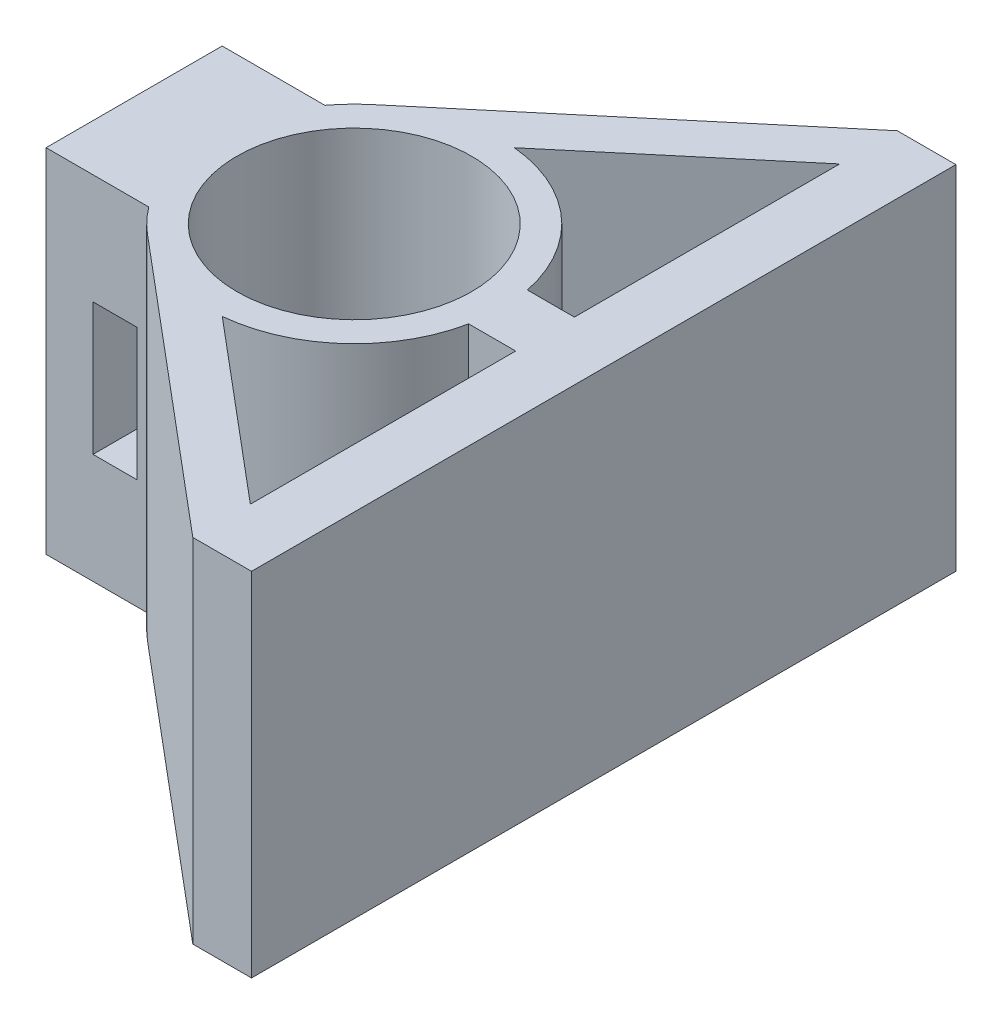
ISO-10303-21;
HEADER;
FILE_DESCRIPTION(('STEP AP214'),'2;1');
FILE_NAME('part.step','',(''),(''),'','','');
FILE_SCHEMA(('AUTOMOTIVE_DESIGN { 1 0 10303 214 1 1 1 1 }'));
ENDSEC;
DATA;
#1=APPLICATION_CONTEXT('core data for automotive mechanical design processes');
#2=APPLICATION_PROTOCOL_DEFINITION('international standard','automotive_design',2000,#1);
#3=PRODUCT_CONTEXT('',#1,'mechanical');
#4=PRODUCT('Part','Part','',(#3));
#5=PRODUCT_RELATED_PRODUCT_CATEGORY('part','',(#4));
#6=PRODUCT_DEFINITION_FORMATION('','',#4);
#7=PRODUCT_DEFINITION_CONTEXT('part definition',#1,'design');
#8=PRODUCT_DEFINITION('design','',#6,#7);
#9=PRODUCT_DEFINITION_SHAPE('','',#8);
#10=(LENGTH_UNIT() NAMED_UNIT(*) SI_UNIT(.MILLI.,.METRE.));
#11=(NAMED_UNIT(*) PLANE_ANGLE_UNIT() SI_UNIT($,.RADIAN.));
#12=(NAMED_UNIT(*) SI_UNIT($,.STERADIAN.) SOLID_ANGLE_UNIT());
#13=UNCERTAINTY_MEASURE_WITH_UNIT(LENGTH_MEASURE(1.E-05),#10,'distance_accuracy_value','');
#14=(GEOMETRIC_REPRESENTATION_CONTEXT(3) GLOBAL_UNCERTAINTY_ASSIGNED_CONTEXT((#13)) GLOBAL_UNIT_ASSIGNED_CONTEXT((#10,
#11,#12)) REPRESENTATION_CONTEXT('',''));
#15=CARTESIAN_POINT('',(0.,0.,0.));
#16=DIRECTION('',(0.,0.,1.));
#17=DIRECTION('',(1.,0.,0.));
#18=AXIS2_PLACEMENT_3D('',#15,#16,#17);
#19=CARTESIAN_POINT('',(0.,-6.,0.));
#20=DIRECTION('',(0.,1.,0.));
#21=DIRECTION('',(0.,0.,1.));
#22=AXIS2_PLACEMENT_3D('',#19,#20,#21);
#23=CYLINDRICAL_SURFACE('',#22,5.);
#24=DIRECTION('',(0.,1.,0.));
#25=VECTOR('',#24,1.);
#26=CARTESIAN_POINT('',(-4.,-6.,-3.));
#27=LINE('',#26,#25);
#28=CARTESIAN_POINT('',(-4.,-6.,-3.));
#29=VERTEX_POINT('',#28);
#30=CARTESIAN_POINT('',(-4.,6.,-3.));
#31=VERTEX_POINT('',#30);
#32=EDGE_CURVE('E42',#29,#31,#27,.T.);
#33=ORIENTED_EDGE('',*,*,#32,.T.);
#34=CARTESIAN_POINT('',(0.,6.,0.));
#35=DIRECTION('',(0.,1.,0.));
#36=DIRECTION('',(0.,0.,1.));
#37=AXIS2_PLACEMENT_3D('',#34,#35,#36);
#38=CIRCLE('',#37,5.);
#39=CARTESIAN_POINT('',(-3.21828459571553,6.,-3.82657082267925));
#40=VERTEX_POINT('',#39);
#41=EDGE_CURVE('E271',#40,#31,#38,.T.);
#42=ORIENTED_EDGE('',*,*,#41,.F.);
#43=DIRECTION('',(0.,1.,0.));
#44=VECTOR('',#43,1.);
#45=CARTESIAN_POINT('',(-3.21828459571553,-6.,-3.82657082267925));
#46=LINE('',#45,#44);
#47=CARTESIAN_POINT('',(-3.21828459571553,-6.,-3.82657082267925));
#48=VERTEX_POINT('',#47);
#49=EDGE_CURVE('E11',#48,#40,#46,.T.);
#50=ORIENTED_EDGE('',*,*,#49,.F.);
#51=CARTESIAN_POINT('',(0.,-6.,0.));
#52=DIRECTION('',(0.,1.,0.));
#53=DIRECTION('',(0.,0.,1.));
#54=AXIS2_PLACEMENT_3D('',#51,#52,#53);
#55=CIRCLE('',#54,5.);
#56=EDGE_CURVE('E371',#48,#29,#55,.T.);
#57=ORIENTED_EDGE('',*,*,#56,.T.);
#58=EDGE_LOOP('',(#33,#42,#50,#57));
#59=FACE_BOUND('',#58,.T.);
#60=ADVANCED_FACE('F39',(#59),#23,.T.);
#61=CARTESIAN_POINT('',(6.5,-6.,-12.));
#62=DIRECTION('',(-0.643656919143106,0.,-0.765314164535849));
#63=DIRECTION('',(-0.76531416453585,0.,0.643656919143106));
#64=AXIS2_PLACEMENT_3D('',#61,#62,#63);
#65=PLANE('',#64);
#66=ORIENTED_EDGE('',*,*,#49,.T.);
#67=DIRECTION('',(-0.765314164535849,0.,0.643656919143106));
#68=VECTOR('',#67,1.);
#69=CARTESIAN_POINT('',(6.5,6.,-12.));
#70=LINE('',#69,#68);
#71=CARTESIAN_POINT('',(6.5,6.,-12.));
#72=VERTEX_POINT('',#71);
#73=EDGE_CURVE('E307',#72,#40,#70,.T.);
#74=ORIENTED_EDGE('',*,*,#73,.F.);
#75=DIRECTION('',(0.,1.,0.));
#76=VECTOR('',#75,1.);
#77=CARTESIAN_POINT('',(6.5,-6.,-12.));
#78=LINE('',#77,#76);
#79=CARTESIAN_POINT('',(6.5,-6.,-12.));
#80=VERTEX_POINT('',#79);
#81=EDGE_CURVE('E48',#80,#72,#78,.T.);
#82=ORIENTED_EDGE('',*,*,#81,.F.);
#83=DIRECTION('',(-0.765314164535849,0.,0.643656919143106));
#84=VECTOR('',#83,1.);
#85=CARTESIAN_POINT('',(6.5,-6.,-12.));
#86=LINE('',#85,#84);
#87=EDGE_CURVE('E406',#80,#48,#86,.T.);
#88=ORIENTED_EDGE('',*,*,#87,.T.);
#89=EDGE_LOOP('',(#66,#74,#82,#88));
#90=FACE_BOUND('',#89,.T.);
#91=ADVANCED_FACE('F444',(#90),#65,.T.);
#92=CARTESIAN_POINT('',(8.5,-6.,-12.));
#93=DIRECTION('',(0.,0.,-1.));
#94=DIRECTION('',(-1.,0.,0.));
#95=AXIS2_PLACEMENT_3D('',#92,#93,#94);
#96=PLANE('',#95);
#97=ORIENTED_EDGE('',*,*,#81,.T.);
#98=DIRECTION('',(-1.,0.,0.));
#99=VECTOR('',#98,1.);
#100=CARTESIAN_POINT('',(8.5,6.,-12.));
#101=LINE('',#100,#99);
#102=CARTESIAN_POINT('',(8.5,6.,-12.));
#103=VERTEX_POINT('',#102);
#104=EDGE_CURVE('E303',#103,#72,#101,.T.);
#105=ORIENTED_EDGE('',*,*,#104,.F.);
#106=DIRECTION('',(0.,1.,0.));
#107=VECTOR('',#106,1.);
#108=CARTESIAN_POINT('',(8.5,-6.,-12.));
#109=LINE('',#108,#107);
#110=CARTESIAN_POINT('',(8.5,-6.,-12.));
#111=VERTEX_POINT('',#110);
#112=EDGE_CURVE('E412',#111,#103,#109,.T.);
#113=ORIENTED_EDGE('',*,*,#112,.F.);
#114=DIRECTION('',(-1.,0.,0.));
#115=VECTOR('',#114,1.);
#116=CARTESIAN_POINT('',(8.5,-6.,-12.));
#117=LINE('',#116,#115);
#118=EDGE_CURVE('E402',#111,#80,#117,.T.);
#119=ORIENTED_EDGE('',*,*,#118,.T.);
#120=EDGE_LOOP('',(#97,#105,#113,#119));
#121=FACE_BOUND('',#120,.T.);
#122=ADVANCED_FACE('F474',(#121),#96,.T.);
#123=CARTESIAN_POINT('',(8.5,-6.,1.90555236810274));
#124=DIRECTION('',(1.,0.,0.));
#125=DIRECTION('',(0.,0.,-1.));
#126=AXIS2_PLACEMENT_3D('',#123,#124,#125);
#127=PLANE('',#126);
#128=ORIENTED_EDGE('',*,*,#112,.T.);
#129=DIRECTION('',(0.,0.,-1.));
#130=VECTOR('',#129,1.);
#131=CARTESIAN_POINT('',(8.5,6.,1.90555236810274));
#132=LINE('',#131,#130);
#133=CARTESIAN_POINT('',(8.5,6.,12.));
#134=VERTEX_POINT('',#133);
#135=EDGE_CURVE('E299',#134,#103,#132,.T.);
#136=ORIENTED_EDGE('',*,*,#135,.F.);
#137=DIRECTION('',(0.,1.,0.));
#138=VECTOR('',#137,1.);
#139=CARTESIAN_POINT('',(8.5,-6.,12.));
#140=LINE('',#139,#138);
#141=CARTESIAN_POINT('',(8.5,-6.,12.));
#142=VERTEX_POINT('',#141);
#143=EDGE_CURVE('E415',#142,#134,#140,.T.);
#144=ORIENTED_EDGE('',*,*,#143,.F.);
#145=DIRECTION('',(0.,0.,-1.));
#146=VECTOR('',#145,1.);
#147=CARTESIAN_POINT('',(8.5,-6.,1.90555236810274));
#148=LINE('',#147,#146);
#149=EDGE_CURVE('E399',#142,#111,#148,.T.);
#150=ORIENTED_EDGE('',*,*,#149,.T.);
#151=EDGE_LOOP('',(#128,#136,#144,#150));
#152=FACE_BOUND('',#151,.T.);
#153=ADVANCED_FACE('F471',(#152),#127,.T.);
#154=CARTESIAN_POINT('',(8.5,-6.,12.));
#155=DIRECTION('',(0.,0.,1.));
#156=DIRECTION('',(1.,0.,0.));
#157=AXIS2_PLACEMENT_3D('',#154,#155,#156);
#158=PLANE('',#157);
#159=ORIENTED_EDGE('',*,*,#143,.T.);
#160=DIRECTION('',(1.,0.,0.));
#161=VECTOR('',#160,1.);
#162=CARTESIAN_POINT('',(8.5,6.,12.));
#163=LINE('',#162,#161);
#164=CARTESIAN_POINT('',(6.5,6.,12.));
#165=VERTEX_POINT('',#164);
#166=EDGE_CURVE('E295',#165,#134,#163,.T.);
#167=ORIENTED_EDGE('',*,*,#166,.F.);
#168=DIRECTION('',(0.,1.,0.));
#169=VECTOR('',#168,1.);
#170=CARTESIAN_POINT('',(6.5,-6.,12.));
#171=LINE('',#170,#169);
#172=CARTESIAN_POINT('',(6.5,-6.,12.));
#173=VERTEX_POINT('',#172);
#174=EDGE_CURVE('E418',#173,#165,#171,.T.);
#175=ORIENTED_EDGE('',*,*,#174,.F.);
#176=DIRECTION('',(1.,0.,0.));
#177=VECTOR('',#176,1.);
#178=CARTESIAN_POINT('',(8.5,-6.,12.));
#179=LINE('',#178,#177);
#180=EDGE_CURVE('E395',#173,#142,#179,.T.);
#181=ORIENTED_EDGE('',*,*,#180,.T.);
#182=EDGE_LOOP('',(#159,#167,#175,#181));
#183=FACE_BOUND('',#182,.T.);
#184=ADVANCED_FACE('F469',(#183),#158,.T.);
#185=CARTESIAN_POINT('',(6.5,-6.,12.));
#186=DIRECTION('',(-0.643656919143106,0.,0.765314164535849));
#187=DIRECTION('',(0.765314164535849,0.,0.643656919143106));
#188=AXIS2_PLACEMENT_3D('',#185,#186,#187);
#189=PLANE('',#188);
#190=ORIENTED_EDGE('',*,*,#174,.T.);
#191=DIRECTION('',(0.765314164535849,0.,0.643656919143106));
#192=VECTOR('',#191,1.);
#193=CARTESIAN_POINT('',(6.5,6.,12.));
#194=LINE('',#193,#192);
#195=CARTESIAN_POINT('',(-3.21828459571553,6.,3.82657082267925));
#196=VERTEX_POINT('',#195);
#197=EDGE_CURVE('E291',#196,#165,#194,.T.);
#198=ORIENTED_EDGE('',*,*,#197,.F.);
#199=DIRECTION('',(0.,1.,0.));
#200=VECTOR('',#199,1.);
#201=CARTESIAN_POINT('',(-3.21828459571553,-6.,3.82657082267925));
#202=LINE('',#201,#200);
#203=CARTESIAN_POINT('',(-3.21828459571553,-6.,3.82657082267925));
#204=VERTEX_POINT('',#203);
#205=EDGE_CURVE('E421',#204,#196,#202,.T.);
#206=ORIENTED_EDGE('',*,*,#205,.F.);
#207=DIRECTION('',(0.765314164535849,0.,0.643656919143106));
#208=VECTOR('',#207,1.);
#209=CARTESIAN_POINT('',(6.5,-6.,12.));
#210=LINE('',#209,#208);
#211=EDGE_CURVE('E391',#204,#173,#210,.T.);
#212=ORIENTED_EDGE('',*,*,#211,.T.);
#213=EDGE_LOOP('',(#190,#198,#206,#212));
#214=FACE_BOUND('',#213,.T.);
#215=ADVANCED_FACE('F464',(#214),#189,.T.);
#216=CARTESIAN_POINT('',(0.,-6.,0.));
#217=DIRECTION('',(0.,1.,0.));
#218=DIRECTION('',(0.,0.,1.));
#219=AXIS2_PLACEMENT_3D('',#216,#217,#218);
#220=CYLINDRICAL_SURFACE('',#219,5.);
#221=ORIENTED_EDGE('',*,*,#205,.T.);
#222=CARTESIAN_POINT('',(0.,6.,0.));
#223=DIRECTION('',(0.,1.,0.));
#224=DIRECTION('',(0.,0.,1.));
#225=AXIS2_PLACEMENT_3D('',#222,#223,#224);
#226=CIRCLE('',#225,5.);
#227=CARTESIAN_POINT('',(-4.,6.,3.));
#228=VERTEX_POINT('',#227);
#229=EDGE_CURVE('E287',#228,#196,#226,.T.);
#230=ORIENTED_EDGE('',*,*,#229,.F.);
#231=DIRECTION('',(0.,1.,0.));
#232=VECTOR('',#231,1.);
#233=CARTESIAN_POINT('',(-4.,-6.,3.));
#234=LINE('',#233,#232);
#235=CARTESIAN_POINT('',(-4.,-6.,3.));
#236=VERTEX_POINT('',#235);
#237=EDGE_CURVE('E424',#236,#228,#234,.T.);
#238=ORIENTED_EDGE('',*,*,#237,.F.);
#239=CARTESIAN_POINT('',(0.,-6.,0.));
#240=DIRECTION('',(0.,1.,0.));
#241=DIRECTION('',(0.,0.,1.));
#242=AXIS2_PLACEMENT_3D('',#239,#240,#241);
#243=CIRCLE('',#242,5.);
#244=EDGE_CURVE('E387',#236,#204,#243,.T.);
#245=ORIENTED_EDGE('',*,*,#244,.T.);
#246=EDGE_LOOP('',(#221,#230,#238,#245));
#247=FACE_BOUND('',#246,.T.);
#248=ADVANCED_FACE('F459',(#247),#220,.T.);
#249=CARTESIAN_POINT('',(-4.,-6.,3.));
#250=DIRECTION('',(0.,0.,1.));
#251=DIRECTION('',(1.,0.,0.));
#252=AXIS2_PLACEMENT_3D('',#249,#250,#251);
#253=PLANE('',#252);
#254=DIRECTION('',(-1.,0.,0.));
#255=VECTOR('',#254,1.);
#256=CARTESIAN_POINT('',(-4.,2.25,3.));
#257=LINE('',#256,#255);
#258=CARTESIAN_POINT('',(-4.4,2.25,3.));
#259=VERTEX_POINT('',#258);
#260=CARTESIAN_POINT('',(-5.9,2.25,3.));
#261=VERTEX_POINT('',#260);
#262=EDGE_CURVE('E232',#259,#261,#257,.T.);
#263=ORIENTED_EDGE('',*,*,#262,.F.);
#264=DIRECTION('',(0.,1.,0.));
#265=VECTOR('',#264,1.);
#266=CARTESIAN_POINT('',(-4.4,-6.,3.));
#267=LINE('',#266,#265);
#268=CARTESIAN_POINT('',(-4.4,-2.25,3.));
#269=VERTEX_POINT('',#268);
#270=EDGE_CURVE('E220',#269,#259,#267,.T.);
#271=ORIENTED_EDGE('',*,*,#270,.F.);
#272=DIRECTION('',(1.,0.,0.));
#273=VECTOR('',#272,1.);
#274=CARTESIAN_POINT('',(-4.,-2.25,3.));
#275=LINE('',#274,#273);
#276=CARTESIAN_POINT('',(-5.9,-2.25,3.));
#277=VERTEX_POINT('',#276);
#278=EDGE_CURVE('E195',#277,#269,#275,.T.);
#279=ORIENTED_EDGE('',*,*,#278,.F.);
#280=DIRECTION('',(0.,-1.,0.));
#281=VECTOR('',#280,1.);
#282=CARTESIAN_POINT('',(-5.9,-6.,3.));
#283=LINE('',#282,#281);
#284=EDGE_CURVE('E229',#261,#277,#283,.T.);
#285=ORIENTED_EDGE('',*,*,#284,.F.);
#286=EDGE_LOOP('',(#263,#271,#279,#285));
#287=FACE_BOUND('',#286,.T.);
#288=ORIENTED_EDGE('',*,*,#237,.T.);
#289=DIRECTION('',(1.,0.,0.));
#290=VECTOR('',#289,1.);
#291=CARTESIAN_POINT('',(-4.,6.,3.));
#292=LINE('',#291,#290);
#293=CARTESIAN_POINT('',(-7.5,6.,3.));
#294=VERTEX_POINT('',#293);
#295=EDGE_CURVE('E283',#294,#228,#292,.T.);
#296=ORIENTED_EDGE('',*,*,#295,.F.);
#297=DIRECTION('',(0.,1.,0.));
#298=VECTOR('',#297,1.);
#299=CARTESIAN_POINT('',(-7.5,-6.,3.));
#300=LINE('',#299,#298);
#301=CARTESIAN_POINT('',(-7.5,-6.,3.));
#302=VERTEX_POINT('',#301);
#303=EDGE_CURVE('E427',#302,#294,#300,.T.);
#304=ORIENTED_EDGE('',*,*,#303,.F.);
#305=DIRECTION('',(1.,0.,0.));
#306=VECTOR('',#305,1.);
#307=CARTESIAN_POINT('',(-4.,-6.,3.));
#308=LINE('',#307,#306);
#309=EDGE_CURVE('E383',#302,#236,#308,.T.);
#310=ORIENTED_EDGE('',*,*,#309,.T.);
#311=EDGE_LOOP('',(#288,#296,#304,#310));
#312=FACE_BOUND('',#311,.T.);
#313=ADVANCED_FACE('F457',(#287,#312),#253,.T.);
#314=CARTESIAN_POINT('',(-7.5,-6.,-3.));
#315=DIRECTION('',(-1.,0.,0.));
#316=DIRECTION('',(0.,0.,1.));
#317=AXIS2_PLACEMENT_3D('',#314,#315,#316);
#318=PLANE('',#317);
#319=ORIENTED_EDGE('',*,*,#303,.T.);
#320=DIRECTION('',(0.,0.,1.));
#321=VECTOR('',#320,1.);
#322=CARTESIAN_POINT('',(-7.5,6.,-3.));
#323=LINE('',#322,#321);
#324=CARTESIAN_POINT('',(-7.5,6.,-3.));
#325=VERTEX_POINT('',#324);
#326=EDGE_CURVE('E279',#325,#294,#323,.T.);
#327=ORIENTED_EDGE('',*,*,#326,.F.);
#328=DIRECTION('',(0.,1.,0.));
#329=VECTOR('',#328,1.);
#330=CARTESIAN_POINT('',(-7.5,-6.,-3.));
#331=LINE('',#330,#329);
#332=CARTESIAN_POINT('',(-7.5,-6.,-3.));
#333=VERTEX_POINT('',#332);
#334=EDGE_CURVE('E429',#333,#325,#331,.T.);
#335=ORIENTED_EDGE('',*,*,#334,.F.);
#336=DIRECTION('',(0.,0.,1.));
#337=VECTOR('',#336,1.);
#338=CARTESIAN_POINT('',(-7.5,-6.,-3.));
#339=LINE('',#338,#337);
#340=EDGE_CURVE('E379',#333,#302,#339,.T.);
#341=ORIENTED_EDGE('',*,*,#340,.T.);
#342=EDGE_LOOP('',(#319,#327,#335,#341));
#343=FACE_BOUND('',#342,.T.);
#344=ADVANCED_FACE('F453',(#343),#318,.T.);
#345=CARTESIAN_POINT('',(-4.,-6.,-3.));
#346=DIRECTION('',(0.,0.,-1.));
#347=DIRECTION('',(-1.,0.,0.));
#348=AXIS2_PLACEMENT_3D('',#345,#346,#347);
#349=PLANE('',#348);
#350=DIRECTION('',(1.,0.,0.));
#351=VECTOR('',#350,1.);
#352=CARTESIAN_POINT('',(-4.4,2.25,-3.));
#353=LINE('',#352,#351);
#354=CARTESIAN_POINT('',(-5.9,2.25,-3.));
#355=VERTEX_POINT('',#354);
#356=CARTESIAN_POINT('',(-4.4,2.25,-3.));
#357=VERTEX_POINT('',#356);
#358=EDGE_CURVE('E64',#355,#357,#353,.T.);
#359=ORIENTED_EDGE('',*,*,#358,.F.);
#360=DIRECTION('',(0.,1.,0.));
#361=VECTOR('',#360,1.);
#362=CARTESIAN_POINT('',(-5.9,2.25,-3.));
#363=LINE('',#362,#361);
#364=CARTESIAN_POINT('',(-5.9,-2.25,-3.));
#365=VERTEX_POINT('',#364);
#366=EDGE_CURVE('E210',#365,#355,#363,.T.);
#367=ORIENTED_EDGE('',*,*,#366,.F.);
#368=DIRECTION('',(-1.,0.,0.));
#369=VECTOR('',#368,1.);
#370=CARTESIAN_POINT('',(-4.4,-2.25,-3.));
#371=LINE('',#370,#369);
#372=CARTESIAN_POINT('',(-4.4,-2.25,-3.));
#373=VERTEX_POINT('',#372);
#374=EDGE_CURVE('E192',#373,#365,#371,.T.);
#375=ORIENTED_EDGE('',*,*,#374,.F.);
#376=DIRECTION('',(0.,-1.,0.));
#377=VECTOR('',#376,1.);
#378=CARTESIAN_POINT('',(-4.4,-2.25,-3.));
#379=LINE('',#378,#377);
#380=EDGE_CURVE('E202',#357,#373,#379,.T.);
#381=ORIENTED_EDGE('',*,*,#380,.F.);
#382=EDGE_LOOP('',(#359,#367,#375,#381));
#383=FACE_BOUND('',#382,.T.);
#384=ORIENTED_EDGE('',*,*,#334,.T.);
#385=DIRECTION('',(-1.,0.,0.));
#386=VECTOR('',#385,1.);
#387=CARTESIAN_POINT('',(-4.,6.,-3.));
#388=LINE('',#387,#386);
#389=EDGE_CURVE('E275',#31,#325,#388,.T.);
#390=ORIENTED_EDGE('',*,*,#389,.F.);
#391=ORIENTED_EDGE('',*,*,#32,.F.);
#392=DIRECTION('',(-1.,0.,0.));
#393=VECTOR('',#392,1.);
#394=CARTESIAN_POINT('',(-4.,-6.,-3.));
#395=LINE('',#394,#393);
#396=EDGE_CURVE('E375',#29,#333,#395,.T.);
#397=ORIENTED_EDGE('',*,*,#396,.T.);
#398=EDGE_LOOP('',(#384,#390,#391,#397));
#399=FACE_BOUND('',#398,.T.);
#400=ADVANCED_FACE('F207',(#383,#399),#349,.T.);
#401=CARTESIAN_POINT('',(0.,-6.,0.));
#402=DIRECTION('',(0.,1.,0.));
#403=DIRECTION('',(0.,0.,1.));
#404=AXIS2_PLACEMENT_3D('',#401,#402,#403);
#405=PLANE('',#404);
#406=DIRECTION('',(-1.,0.,0.));
#407=VECTOR('',#406,1.);
#408=CARTESIAN_POINT('',(4.89897948556636,-6.,0.999999999999999));
#409=LINE('',#408,#407);
#410=CARTESIAN_POINT('',(6.5,-6.,0.999999999999999));
#411=VERTEX_POINT('',#410);
#412=CARTESIAN_POINT('',(4.89897948556636,-6.,0.999999999999999));
#413=VERTEX_POINT('',#412);
#414=EDGE_CURVE('E323',#411,#413,#409,.T.);
#415=ORIENTED_EDGE('',*,*,#414,.T.);
#416=CARTESIAN_POINT('',(0.,-6.,0.));
#417=DIRECTION('',(0.,-1.,0.));
#418=DIRECTION('',(0.,0.,1.));
#419=AXIS2_PLACEMENT_3D('',#416,#417,#418);
#420=CIRCLE('',#419,5.);
#421=CARTESIAN_POINT('',(0.479918948690546,-6.,4.97691448617392));
#422=VERTEX_POINT('',#421);
#423=EDGE_CURVE('E311',#413,#422,#420,.T.);
#424=ORIENTED_EDGE('',*,*,#423,.T.);
#425=DIRECTION('',(0.765314164535849,0.,0.643656919143106));
#426=VECTOR('',#425,1.);
#427=CARTESIAN_POINT('',(6.5,-6.,10.0400205961042));
#428=LINE('',#427,#426);
#429=CARTESIAN_POINT('',(6.5,-6.,10.0400205961042));
#430=VERTEX_POINT('',#429);
#431=EDGE_CURVE('E315',#422,#430,#428,.T.);
#432=ORIENTED_EDGE('',*,*,#431,.T.);
#433=DIRECTION('',(0.,0.,-1.));
#434=VECTOR('',#433,1.);
#435=CARTESIAN_POINT('',(6.5,-6.,0.999999999999999));
#436=LINE('',#435,#434);
#437=EDGE_CURVE('E319',#430,#411,#436,.T.);
#438=ORIENTED_EDGE('',*,*,#437,.T.);
#439=EDGE_LOOP('',(#415,#424,#432,#438));
#440=FACE_BOUND('',#439,.T.);
#441=DIRECTION('',(-0.765314164535849,0.,0.643656919143106));
#442=VECTOR('',#441,1.);
#443=CARTESIAN_POINT('',(6.5,-6.,-10.0400205961042));
#444=LINE('',#443,#442);
#445=CARTESIAN_POINT('',(6.5,-6.,-10.0400205961042));
#446=VERTEX_POINT('',#445);
#447=CARTESIAN_POINT('',(0.479918948690545,-6.,-4.97691448617392));
#448=VERTEX_POINT('',#447);
#449=EDGE_CURVE('E351',#446,#448,#444,.T.);
#450=ORIENTED_EDGE('',*,*,#449,.T.);
#451=CARTESIAN_POINT('',(0.,-6.,0.));
#452=DIRECTION('',(0.,-1.,0.));
#453=DIRECTION('',(0.,0.,1.));
#454=AXIS2_PLACEMENT_3D('',#451,#452,#453);
#455=CIRCLE('',#454,5.);
#456=CARTESIAN_POINT('',(4.89897948556636,-6.,-1.));
#457=VERTEX_POINT('',#456);
#458=EDGE_CURVE('E331',#448,#457,#455,.T.);
#459=ORIENTED_EDGE('',*,*,#458,.T.);
#460=DIRECTION('',(1.,0.,0.));
#461=VECTOR('',#460,1.);
#462=CARTESIAN_POINT('',(4.89897948556636,-6.,-1.));
#463=LINE('',#462,#461);
#464=CARTESIAN_POINT('',(6.5,-6.,-1.));
#465=VERTEX_POINT('',#464);
#466=EDGE_CURVE('E343',#457,#465,#463,.T.);
#467=ORIENTED_EDGE('',*,*,#466,.T.);
#468=DIRECTION('',(0.,0.,-1.));
#469=VECTOR('',#468,1.);
#470=CARTESIAN_POINT('',(6.5,-6.,-1.));
#471=LINE('',#470,#469);
#472=EDGE_CURVE('E347',#465,#446,#471,.T.);
#473=ORIENTED_EDGE('',*,*,#472,.T.);
#474=EDGE_LOOP('',(#450,#459,#467,#473));
#475=FACE_BOUND('',#474,.T.);
#476=CARTESIAN_POINT('',(0.,-6.,0.));
#477=DIRECTION('',(0.,1.,0.));
#478=DIRECTION('',(0.,0.,1.));
#479=AXIS2_PLACEMENT_3D('',#476,#477,#478);
#480=CIRCLE('',#479,4.);
#481=CARTESIAN_POINT('',(0.,-6.,4.));
#482=VERTEX_POINT('',#481);
#483=EDGE_CURVE('E359',#482,#482,#480,.T.);
#484=ORIENTED_EDGE('',*,*,#483,.T.);
#485=EDGE_LOOP('',(#484));
#486=FACE_BOUND('',#485,.T.);
#487=ORIENTED_EDGE('',*,*,#56,.F.);
#488=ORIENTED_EDGE('',*,*,#87,.F.);
#489=ORIENTED_EDGE('',*,*,#118,.F.);
#490=ORIENTED_EDGE('',*,*,#149,.F.);
#491=ORIENTED_EDGE('',*,*,#180,.F.);
#492=ORIENTED_EDGE('',*,*,#211,.F.);
#493=ORIENTED_EDGE('',*,*,#244,.F.);
#494=ORIENTED_EDGE('',*,*,#309,.F.);
#495=ORIENTED_EDGE('',*,*,#340,.F.);
#496=ORIENTED_EDGE('',*,*,#396,.F.);
#497=EDGE_LOOP('',(#487,#488,#489,#490,#491,#492,#493,#494,#495,#496));
#498=FACE_BOUND('',#497,.T.);
#499=ADVANCED_FACE('F447',(#440,#475,#486,#498),#405,.F.);
#500=CARTESIAN_POINT('',(0.,-6.,0.));
#501=DIRECTION('',(0.,1.,0.));
#502=DIRECTION('',(0.,0.,1.));
#503=AXIS2_PLACEMENT_3D('',#500,#501,#502);
#504=CYLINDRICAL_SURFACE('',#503,4.);
#505=ORIENTED_EDGE('',*,*,#483,.F.);
#506=EDGE_LOOP('',(#505));
#507=FACE_BOUND('',#506,.T.);
#508=CARTESIAN_POINT('',(0.,6.,0.));
#509=DIRECTION('',(0.,1.,0.));
#510=DIRECTION('',(0.,0.,1.));
#511=AXIS2_PLACEMENT_3D('',#508,#509,#510);
#512=CIRCLE('',#511,4.);
#513=CARTESIAN_POINT('',(0.,6.,4.));
#514=VERTEX_POINT('',#513);
#515=EDGE_CURVE('E267',#514,#514,#512,.T.);
#516=ORIENTED_EDGE('',*,*,#515,.T.);
#517=EDGE_LOOP('',(#516));
#518=FACE_BOUND('',#517,.T.);
#519=ADVANCED_FACE('F546',(#507,#518),#504,.F.);
#520=CARTESIAN_POINT('',(0.,-6.,0.));
#521=DIRECTION('',(0.,1.,0.));
#522=DIRECTION('',(0.,0.,1.));
#523=AXIS2_PLACEMENT_3D('',#520,#521,#522);
#524=CYLINDRICAL_SURFACE('',#523,5.);
#525=DIRECTION('',(0.,1.,0.));
#526=VECTOR('',#525,1.);
#527=CARTESIAN_POINT('',(0.479918948690545,-6.,-4.97691448617392));
#528=LINE('',#527,#526);
#529=CARTESIAN_POINT('',(0.479918948690545,6.,-4.97691448617392));
#530=VERTEX_POINT('',#529);
#531=EDGE_CURVE('E356',#448,#530,#528,.T.);
#532=ORIENTED_EDGE('',*,*,#531,.T.);
#533=CARTESIAN_POINT('',(0.,6.,0.));
#534=DIRECTION('',(0.,-1.,0.));
#535=DIRECTION('',(0.,0.,1.));
#536=AXIS2_PLACEMENT_3D('',#533,#534,#535);
#537=CIRCLE('',#536,5.);
#538=CARTESIAN_POINT('',(4.89897948556636,6.,-1.));
#539=VERTEX_POINT('',#538);
#540=EDGE_CURVE('E251',#530,#539,#537,.T.);
#541=ORIENTED_EDGE('',*,*,#540,.T.);
#542=DIRECTION('',(0.,1.,0.));
#543=VECTOR('',#542,1.);
#544=CARTESIAN_POINT('',(4.89897948556636,-6.,-1.));
#545=LINE('',#544,#543);
#546=EDGE_CURVE('E355',#457,#539,#545,.T.);
#547=ORIENTED_EDGE('',*,*,#546,.F.);
#548=ORIENTED_EDGE('',*,*,#458,.F.);
#549=EDGE_LOOP('',(#532,#541,#547,#548));
#550=FACE_BOUND('',#549,.T.);
#551=ADVANCED_FACE('F556',(#550),#524,.T.);
#552=CARTESIAN_POINT('',(6.5,-6.,-10.0400205961042));
#553=DIRECTION('',(-0.643656919143106,0.,-0.765314164535849));
#554=DIRECTION('',(-0.76531416453585,0.,0.643656919143106));
#555=AXIS2_PLACEMENT_3D('',#552,#553,#554);
#556=PLANE('',#555);
#557=DIRECTION('',(0.,1.,0.));
#558=VECTOR('',#557,1.);
#559=CARTESIAN_POINT('',(6.5,-6.,-10.0400205961042));
#560=LINE('',#559,#558);
#561=CARTESIAN_POINT('',(6.5,6.,-10.0400205961042));
#562=VERTEX_POINT('',#561);
#563=EDGE_CURVE('E360',#446,#562,#560,.T.);
#564=ORIENTED_EDGE('',*,*,#563,.T.);
#565=DIRECTION('',(-0.765314164535849,0.,0.643656919143106));
#566=VECTOR('',#565,1.);
#567=CARTESIAN_POINT('',(6.5,6.,-10.0400205961042));
#568=LINE('',#567,#566);
#569=EDGE_CURVE('E263',#562,#530,#568,.T.);
#570=ORIENTED_EDGE('',*,*,#569,.T.);
#571=ORIENTED_EDGE('',*,*,#531,.F.);
#572=ORIENTED_EDGE('',*,*,#449,.F.);
#573=EDGE_LOOP('',(#564,#570,#571,#572));
#574=FACE_BOUND('',#573,.T.);
#575=ADVANCED_FACE('F566',(#574),#556,.F.);
#576=CARTESIAN_POINT('',(6.5,-6.,-1.));
#577=DIRECTION('',(1.,0.,0.));
#578=DIRECTION('',(0.,0.,-1.));
#579=AXIS2_PLACEMENT_3D('',#576,#577,#578);
#580=PLANE('',#579);
#581=DIRECTION('',(0.,1.,0.));
#582=VECTOR('',#581,1.);
#583=CARTESIAN_POINT('',(6.5,-6.,-1.));
#584=LINE('',#583,#582);
#585=CARTESIAN_POINT('',(6.5,6.,-1.));
#586=VERTEX_POINT('',#585);
#587=EDGE_CURVE('E363',#465,#586,#584,.T.);
#588=ORIENTED_EDGE('',*,*,#587,.T.);
#589=DIRECTION('',(0.,0.,-1.));
#590=VECTOR('',#589,1.);
#591=CARTESIAN_POINT('',(6.5,6.,-1.));
#592=LINE('',#591,#590);
#593=EDGE_CURVE('E259',#586,#562,#592,.T.);
#594=ORIENTED_EDGE('',*,*,#593,.T.);
#595=ORIENTED_EDGE('',*,*,#563,.F.);
#596=ORIENTED_EDGE('',*,*,#472,.F.);
#597=EDGE_LOOP('',(#588,#594,#595,#596));
#598=FACE_BOUND('',#597,.T.);
#599=ADVANCED_FACE('F576',(#598),#580,.F.);
#600=CARTESIAN_POINT('',(4.89897948556636,-6.,-1.));
#601=DIRECTION('',(0.,0.,1.));
#602=DIRECTION('',(1.,0.,0.));
#603=AXIS2_PLACEMENT_3D('',#600,#601,#602);
#604=PLANE('',#603);
#605=ORIENTED_EDGE('',*,*,#546,.T.);
#606=DIRECTION('',(1.,0.,0.));
#607=VECTOR('',#606,1.);
#608=CARTESIAN_POINT('',(4.89897948556636,6.,-1.));
#609=LINE('',#608,#607);
#610=EDGE_CURVE('E255',#539,#586,#609,.T.);
#611=ORIENTED_EDGE('',*,*,#610,.T.);
#612=ORIENTED_EDGE('',*,*,#587,.F.);
#613=ORIENTED_EDGE('',*,*,#466,.F.);
#614=EDGE_LOOP('',(#605,#611,#612,#613));
#615=FACE_BOUND('',#614,.T.);
#616=ADVANCED_FACE('F586',(#615),#604,.F.);
#617=CARTESIAN_POINT('',(0.,-6.,0.));
#618=DIRECTION('',(0.,1.,0.));
#619=DIRECTION('',(0.,0.,1.));
#620=AXIS2_PLACEMENT_3D('',#617,#618,#619);
#621=CYLINDRICAL_SURFACE('',#620,5.);
#622=DIRECTION('',(0.,1.,0.));
#623=VECTOR('',#622,1.);
#624=CARTESIAN_POINT('',(4.89897948556636,-6.,0.999999999999999));
#625=LINE('',#624,#623);
#626=CARTESIAN_POINT('',(4.89897948556636,6.,0.999999999999999));
#627=VERTEX_POINT('',#626);
#628=EDGE_CURVE('E328',#413,#627,#625,.T.);
#629=ORIENTED_EDGE('',*,*,#628,.T.);
#630=CARTESIAN_POINT('',(0.,6.,0.));
#631=DIRECTION('',(0.,-1.,0.));
#632=DIRECTION('',(0.,0.,1.));
#633=AXIS2_PLACEMENT_3D('',#630,#631,#632);
#634=CIRCLE('',#633,5.);
#635=CARTESIAN_POINT('',(0.479918948690546,6.,4.97691448617392));
#636=VERTEX_POINT('',#635);
#637=EDGE_CURVE('E235',#627,#636,#634,.T.);
#638=ORIENTED_EDGE('',*,*,#637,.T.);
#639=DIRECTION('',(0.,1.,0.));
#640=VECTOR('',#639,1.);
#641=CARTESIAN_POINT('',(0.479918948690546,-6.,4.97691448617392));
#642=LINE('',#641,#640);
#643=EDGE_CURVE('E327',#422,#636,#642,.T.);
#644=ORIENTED_EDGE('',*,*,#643,.F.);
#645=ORIENTED_EDGE('',*,*,#423,.F.);
#646=EDGE_LOOP('',(#629,#638,#644,#645));
#647=FACE_BOUND('',#646,.T.);
#648=ADVANCED_FACE('F596',(#647),#621,.T.);
#649=CARTESIAN_POINT('',(4.89897948556636,-6.,0.999999999999999));
#650=DIRECTION('',(0.,0.,-1.));
#651=DIRECTION('',(-1.,0.,0.));
#652=AXIS2_PLACEMENT_3D('',#649,#650,#651);
#653=PLANE('',#652);
#654=DIRECTION('',(0.,1.,0.));
#655=VECTOR('',#654,1.);
#656=CARTESIAN_POINT('',(6.5,-6.,0.999999999999999));
#657=LINE('',#656,#655);
#658=CARTESIAN_POINT('',(6.5,6.,0.999999999999999));
#659=VERTEX_POINT('',#658);
#660=EDGE_CURVE('E332',#411,#659,#657,.T.);
#661=ORIENTED_EDGE('',*,*,#660,.T.);
#662=DIRECTION('',(-1.,0.,0.));
#663=VECTOR('',#662,1.);
#664=CARTESIAN_POINT('',(4.89897948556636,6.,0.999999999999999));
#665=LINE('',#664,#663);
#666=EDGE_CURVE('E247',#659,#627,#665,.T.);
#667=ORIENTED_EDGE('',*,*,#666,.T.);
#668=ORIENTED_EDGE('',*,*,#628,.F.);
#669=ORIENTED_EDGE('',*,*,#414,.F.);
#670=EDGE_LOOP('',(#661,#667,#668,#669));
#671=FACE_BOUND('',#670,.T.);
#672=ADVANCED_FACE('F606',(#671),#653,.F.);
#673=CARTESIAN_POINT('',(6.5,-6.,0.999999999999999));
#674=DIRECTION('',(1.,0.,0.));
#675=DIRECTION('',(0.,0.,-1.));
#676=AXIS2_PLACEMENT_3D('',#673,#674,#675);
#677=PLANE('',#676);
#678=DIRECTION('',(0.,1.,0.));
#679=VECTOR('',#678,1.);
#680=CARTESIAN_POINT('',(6.5,-6.,10.0400205961042));
#681=LINE('',#680,#679);
#682=CARTESIAN_POINT('',(6.5,6.,10.0400205961042));
#683=VERTEX_POINT('',#682);
#684=EDGE_CURVE('E335',#430,#683,#681,.T.);
#685=ORIENTED_EDGE('',*,*,#684,.T.);
#686=DIRECTION('',(0.,0.,-1.));
#687=VECTOR('',#686,1.);
#688=CARTESIAN_POINT('',(6.5,6.,0.999999999999999));
#689=LINE('',#688,#687);
#690=EDGE_CURVE('E243',#683,#659,#689,.T.);
#691=ORIENTED_EDGE('',*,*,#690,.T.);
#692=ORIENTED_EDGE('',*,*,#660,.F.);
#693=ORIENTED_EDGE('',*,*,#437,.F.);
#694=EDGE_LOOP('',(#685,#691,#692,#693));
#695=FACE_BOUND('',#694,.T.);
#696=ADVANCED_FACE('F616',(#695),#677,.F.);
#697=CARTESIAN_POINT('',(6.5,-6.,10.0400205961042));
#698=DIRECTION('',(-0.643656919143106,0.,0.765314164535849));
#699=DIRECTION('',(0.765314164535849,0.,0.643656919143106));
#700=AXIS2_PLACEMENT_3D('',#697,#698,#699);
#701=PLANE('',#700);
#702=ORIENTED_EDGE('',*,*,#643,.T.);
#703=DIRECTION('',(0.765314164535849,0.,0.643656919143106));
#704=VECTOR('',#703,1.);
#705=CARTESIAN_POINT('',(6.5,6.,10.0400205961042));
#706=LINE('',#705,#704);
#707=EDGE_CURVE('E239',#636,#683,#706,.T.);
#708=ORIENTED_EDGE('',*,*,#707,.T.);
#709=ORIENTED_EDGE('',*,*,#684,.F.);
#710=ORIENTED_EDGE('',*,*,#431,.F.);
#711=EDGE_LOOP('',(#702,#708,#709,#710));
#712=FACE_BOUND('',#711,.T.);
#713=ADVANCED_FACE('F626',(#712),#701,.F.);
#714=CARTESIAN_POINT('',(0.,6.,0.));
#715=DIRECTION('',(0.,1.,0.));
#716=DIRECTION('',(0.,0.,1.));
#717=AXIS2_PLACEMENT_3D('',#714,#715,#716);
#718=PLANE('',#717);
#719=ORIENTED_EDGE('',*,*,#41,.T.);
#720=ORIENTED_EDGE('',*,*,#389,.T.);
#721=ORIENTED_EDGE('',*,*,#326,.T.);
#722=ORIENTED_EDGE('',*,*,#295,.T.);
#723=ORIENTED_EDGE('',*,*,#229,.T.);
#724=ORIENTED_EDGE('',*,*,#197,.T.);
#725=ORIENTED_EDGE('',*,*,#166,.T.);
#726=ORIENTED_EDGE('',*,*,#135,.T.);
#727=ORIENTED_EDGE('',*,*,#104,.T.);
#728=ORIENTED_EDGE('',*,*,#73,.T.);
#729=EDGE_LOOP('',(#719,#720,#721,#722,#723,#724,#725,#726,#727,#728));
#730=FACE_BOUND('',#729,.T.);
#731=ORIENTED_EDGE('',*,*,#515,.F.);
#732=EDGE_LOOP('',(#731));
#733=FACE_BOUND('',#732,.T.);
#734=ORIENTED_EDGE('',*,*,#610,.F.);
#735=ORIENTED_EDGE('',*,*,#540,.F.);
#736=ORIENTED_EDGE('',*,*,#569,.F.);
#737=ORIENTED_EDGE('',*,*,#593,.F.);
#738=EDGE_LOOP('',(#734,#735,#736,#737));
#739=FACE_BOUND('',#738,.T.);
#740=ORIENTED_EDGE('',*,*,#707,.F.);
#741=ORIENTED_EDGE('',*,*,#637,.F.);
#742=ORIENTED_EDGE('',*,*,#666,.F.);
#743=ORIENTED_EDGE('',*,*,#690,.F.);
#744=EDGE_LOOP('',(#740,#741,#742,#743));
#745=FACE_BOUND('',#744,.T.);
#746=ADVANCED_FACE('F439',(#730,#733,#739,#745),#718,.T.);
#747=CARTESIAN_POINT('',(-4.4,2.25,12.));
#748=DIRECTION('',(0.,1.,0.));
#749=DIRECTION('',(0.,0.,1.));
#750=AXIS2_PLACEMENT_3D('',#747,#748,#749);
#751=PLANE('',#750);
#752=ORIENTED_EDGE('',*,*,#262,.T.);
#753=DIRECTION('',(0.,0.,-1.));
#754=VECTOR('',#753,1.);
#755=CARTESIAN_POINT('',(-5.9,2.25,12.));
#756=LINE('',#755,#754);
#757=EDGE_CURVE('E217',#261,#355,#756,.T.);
#758=ORIENTED_EDGE('',*,*,#757,.T.);
#759=ORIENTED_EDGE('',*,*,#358,.T.);
#760=DIRECTION('',(0.,0.,-1.));
#761=VECTOR('',#760,1.);
#762=CARTESIAN_POINT('',(-4.4,2.25,12.));
#763=LINE('',#762,#761);
#764=EDGE_CURVE('E199',#259,#357,#763,.T.);
#765=ORIENTED_EDGE('',*,*,#764,.F.);
#766=EDGE_LOOP('',(#752,#758,#759,#765));
#767=FACE_BOUND('',#766,.T.);
#768=ADVANCED_FACE('F645',(#767),#751,.F.);
#769=CARTESIAN_POINT('',(-5.9,2.25,12.));
#770=DIRECTION('',(-1.,0.,0.));
#771=DIRECTION('',(0.,0.,1.));
#772=AXIS2_PLACEMENT_3D('',#769,#770,#771);
#773=PLANE('',#772);
#774=ORIENTED_EDGE('',*,*,#284,.T.);
#775=DIRECTION('',(0.,0.,-1.));
#776=VECTOR('',#775,1.);
#777=CARTESIAN_POINT('',(-5.9,-2.25,12.));
#778=LINE('',#777,#776);
#779=EDGE_CURVE('E198',#277,#365,#778,.T.);
#780=ORIENTED_EDGE('',*,*,#779,.T.);
#781=ORIENTED_EDGE('',*,*,#366,.T.);
#782=ORIENTED_EDGE('',*,*,#757,.F.);
#783=EDGE_LOOP('',(#774,#780,#781,#782));
#784=FACE_BOUND('',#783,.T.);
#785=ADVANCED_FACE('F666',(#784),#773,.F.);
#786=CARTESIAN_POINT('',(-4.4,-2.25,12.));
#787=DIRECTION('',(0.,-1.,0.));
#788=DIRECTION('',(0.,0.,-1.));
#789=AXIS2_PLACEMENT_3D('',#786,#787,#788);
#790=PLANE('',#789);
#791=ORIENTED_EDGE('',*,*,#278,.T.);
#792=DIRECTION('',(0.,0.,-1.));
#793=VECTOR('',#792,1.);
#794=CARTESIAN_POINT('',(-4.4,-2.25,12.));
#795=LINE('',#794,#793);
#796=EDGE_CURVE('E56',#269,#373,#795,.T.);
#797=ORIENTED_EDGE('',*,*,#796,.T.);
#798=ORIENTED_EDGE('',*,*,#374,.T.);
#799=ORIENTED_EDGE('',*,*,#779,.F.);
#800=EDGE_LOOP('',(#791,#797,#798,#799));
#801=FACE_BOUND('',#800,.T.);
#802=ADVANCED_FACE('F189',(#801),#790,.F.);
#803=CARTESIAN_POINT('',(-4.4,-2.25,12.));
#804=DIRECTION('',(1.,0.,0.));
#805=DIRECTION('',(0.,0.,-1.));
#806=AXIS2_PLACEMENT_3D('',#803,#804,#805);
#807=PLANE('',#806);
#808=ORIENTED_EDGE('',*,*,#270,.T.);
#809=ORIENTED_EDGE('',*,*,#764,.T.);
#810=ORIENTED_EDGE('',*,*,#380,.T.);
#811=ORIENTED_EDGE('',*,*,#796,.F.);
#812=EDGE_LOOP('',(#808,#809,#810,#811));
#813=FACE_BOUND('',#812,.T.);
#814=ADVANCED_FACE('F203',(#813),#807,.F.);
#815=CLOSED_SHELL('',(#60,#91,#122,#153,#184,#215,#248,#313,#344,#400,#499,#519,#551,#575,#599,
#616,#648,#672,#696,#713,#746,#768,#785,#802,#814));
#816=MANIFOLD_SOLID_BREP('B2',#815);
#817=ADVANCED_BREP_SHAPE_REPRESENTATION('',(#18,#816),#14);
#818=SHAPE_DEFINITION_REPRESENTATION(#9,#817);
ENDSEC;
END-ISO-10303-21;
